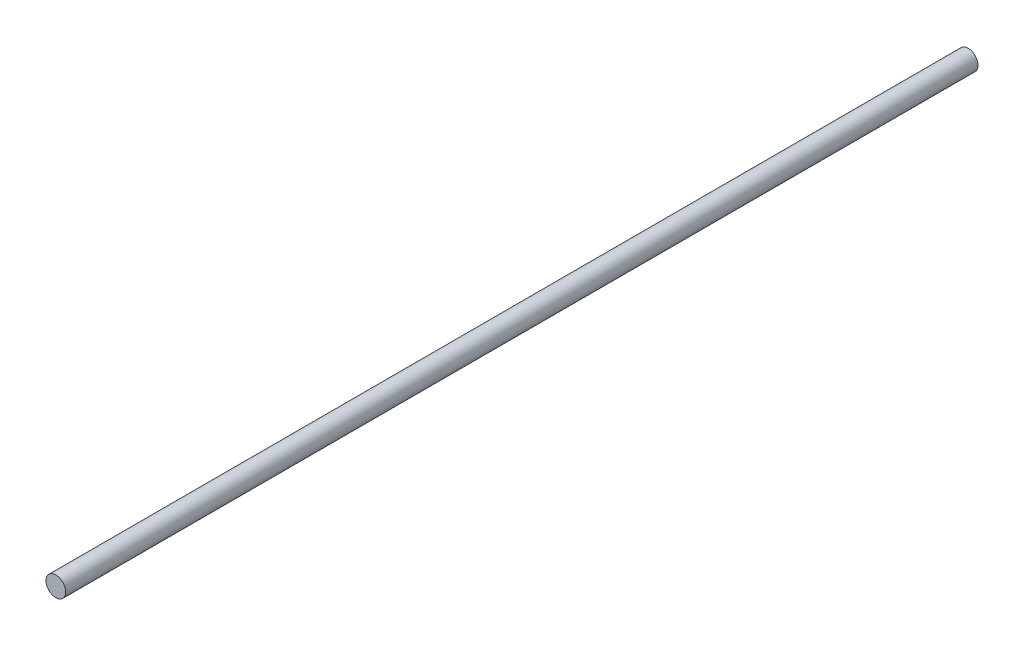
ISO-10303-21;
HEADER;
FILE_DESCRIPTION(('STEP AP214'),'2;1');
FILE_NAME('part.step','',(''),(''),'','','');
FILE_SCHEMA(('AUTOMOTIVE_DESIGN { 1 0 10303 214 1 1 1 1 }'));
ENDSEC;
DATA;
#1=APPLICATION_CONTEXT('core data for automotive mechanical design processes');
#2=APPLICATION_PROTOCOL_DEFINITION('international standard','automotive_design',2000,#1);
#3=PRODUCT_CONTEXT('',#1,'mechanical');
#4=PRODUCT('Part','Part','',(#3));
#5=PRODUCT_RELATED_PRODUCT_CATEGORY('part','',(#4));
#6=PRODUCT_DEFINITION_FORMATION('','',#4);
#7=PRODUCT_DEFINITION_CONTEXT('part definition',#1,'design');
#8=PRODUCT_DEFINITION('design','',#6,#7);
#9=PRODUCT_DEFINITION_SHAPE('','',#8);
#10=(LENGTH_UNIT() NAMED_UNIT(*) SI_UNIT(.MILLI.,.METRE.));
#11=(NAMED_UNIT(*) PLANE_ANGLE_UNIT() SI_UNIT($,.RADIAN.));
#12=(NAMED_UNIT(*) SI_UNIT($,.STERADIAN.) SOLID_ANGLE_UNIT());
#13=UNCERTAINTY_MEASURE_WITH_UNIT(LENGTH_MEASURE(1.E-05),#10,'distance_accuracy_value','');
#14=(GEOMETRIC_REPRESENTATION_CONTEXT(3) GLOBAL_UNCERTAINTY_ASSIGNED_CONTEXT((#13)) GLOBAL_UNIT_ASSIGNED_CONTEXT((#10,
#11,#12)) REPRESENTATION_CONTEXT('',''));
#15=CARTESIAN_POINT('',(0.,0.,0.));
#16=DIRECTION('',(0.,0.,1.));
#17=DIRECTION('',(1.,0.,0.));
#18=AXIS2_PLACEMENT_3D('',#15,#16,#17);
#19=CARTESIAN_POINT('',(0.,0.,370.));
#20=DIRECTION('',(0.,0.,-1.));
#21=DIRECTION('',(-1.,0.,0.));
#22=AXIS2_PLACEMENT_3D('',#19,#20,#21);
#23=CYLINDRICAL_SURFACE('',#22,4.);
#24=CARTESIAN_POINT('',(0.,0.,370.));
#25=DIRECTION('',(0.,0.,1.));
#26=DIRECTION('',(1.,0.,0.));
#27=AXIS2_PLACEMENT_3D('',#24,#25,#26);
#28=CIRCLE('',#27,4.);
#29=CARTESIAN_POINT('',(4.,0.,370.));
#30=VERTEX_POINT('',#29);
#31=EDGE_CURVE('E10',#30,#30,#28,.T.);
#32=ORIENTED_EDGE('',*,*,#31,.F.);
#33=EDGE_LOOP('',(#32));
#34=FACE_BOUND('',#33,.T.);
#35=CARTESIAN_POINT('',(0.,0.,0.));
#36=DIRECTION('',(0.,0.,1.));
#37=DIRECTION('',(1.,0.,0.));
#38=AXIS2_PLACEMENT_3D('',#35,#36,#37);
#39=CIRCLE('',#38,4.);
#40=CARTESIAN_POINT('',(4.,0.,0.));
#41=VERTEX_POINT('',#40);
#42=EDGE_CURVE('E40',#41,#41,#39,.T.);
#43=ORIENTED_EDGE('',*,*,#42,.T.);
#44=EDGE_LOOP('',(#43));
#45=FACE_BOUND('',#44,.T.);
#46=ADVANCED_FACE('F37',(#34,#45),#23,.T.);
#47=CARTESIAN_POINT('',(0.,0.,370.));
#48=DIRECTION('',(0.,0.,1.));
#49=DIRECTION('',(1.,0.,0.));
#50=AXIS2_PLACEMENT_3D('',#47,#48,#49);
#51=PLANE('',#50);
#52=ORIENTED_EDGE('',*,*,#31,.T.);
#53=EDGE_LOOP('',(#52));
#54=FACE_BOUND('',#53,.T.);
#55=ADVANCED_FACE('F54',(#54),#51,.T.);
#56=CARTESIAN_POINT('',(0.,0.,0.));
#57=DIRECTION('',(0.,0.,1.));
#58=DIRECTION('',(1.,0.,0.));
#59=AXIS2_PLACEMENT_3D('',#56,#57,#58);
#60=PLANE('',#59);
#61=ORIENTED_EDGE('',*,*,#42,.F.);
#62=EDGE_LOOP('',(#61));
#63=FACE_BOUND('',#62,.T.);
#64=ADVANCED_FACE('F52',(#63),#60,.F.);
#65=CLOSED_SHELL('',(#46,#55,#64));
#66=MANIFOLD_SOLID_BREP('B2',#65);
#67=ADVANCED_BREP_SHAPE_REPRESENTATION('',(#18,#66),#14);
#68=SHAPE_DEFINITION_REPRESENTATION(#9,#67);
ENDSEC;
END-ISO-10303-21;
